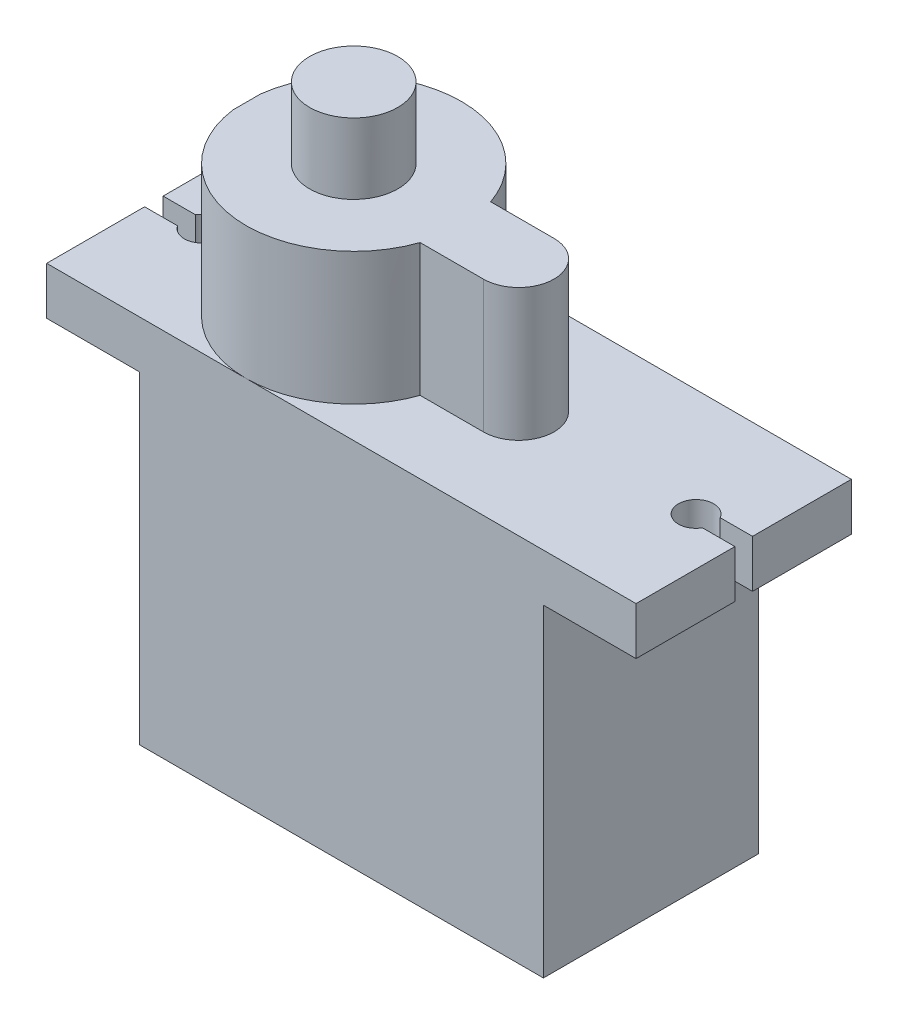
ISO-10303-21;
HEADER;
FILE_DESCRIPTION(('STEP AP214'),'2;1');
FILE_NAME('part.step','',(''),(''),'','','');
FILE_SCHEMA(('AUTOMOTIVE_DESIGN { 1 0 10303 214 1 1 1 1 }'));
ENDSEC;
DATA;
#1=APPLICATION_CONTEXT('core data for automotive mechanical design processes');
#2=APPLICATION_PROTOCOL_DEFINITION('international standard','automotive_design',2000,#1);
#3=PRODUCT_CONTEXT('',#1,'mechanical');
#4=PRODUCT('Part','Part','',(#3));
#5=PRODUCT_RELATED_PRODUCT_CATEGORY('part','',(#4));
#6=PRODUCT_DEFINITION_FORMATION('','',#4);
#7=PRODUCT_DEFINITION_CONTEXT('part definition',#1,'design');
#8=PRODUCT_DEFINITION('design','',#6,#7);
#9=PRODUCT_DEFINITION_SHAPE('','',#8);
#10=(LENGTH_UNIT() NAMED_UNIT(*) SI_UNIT(.MILLI.,.METRE.));
#11=(NAMED_UNIT(*) PLANE_ANGLE_UNIT() SI_UNIT($,.RADIAN.));
#12=(NAMED_UNIT(*) SI_UNIT($,.STERADIAN.) SOLID_ANGLE_UNIT());
#13=UNCERTAINTY_MEASURE_WITH_UNIT(LENGTH_MEASURE(1.E-05),#10,'distance_accuracy_value','');
#14=(GEOMETRIC_REPRESENTATION_CONTEXT(3) GLOBAL_UNCERTAINTY_ASSIGNED_CONTEXT((#13)) GLOBAL_UNIT_ASSIGNED_CONTEXT((#10,
#11,#12)) REPRESENTATION_CONTEXT('',''));
#15=CARTESIAN_POINT('',(0.,0.,0.));
#16=DIRECTION('',(0.,0.,1.));
#17=DIRECTION('',(1.,0.,0.));
#18=AXIS2_PLACEMENT_3D('',#15,#16,#17);
#19=CARTESIAN_POINT('',(28.15,18.3,12.2));
#20=DIRECTION('',(-1.,0.,0.));
#21=DIRECTION('',(0.,0.,1.));
#22=AXIS2_PLACEMENT_3D('',#19,#20,#21);
#23=PLANE('',#22);
#24=DIRECTION('',(0.,0.,-1.));
#25=VECTOR('',#24,1.);
#26=CARTESIAN_POINT('',(28.15,21.,12.2));
#27=LINE('',#26,#25);
#28=CARTESIAN_POINT('',(28.15,21.,5.6));
#29=VERTEX_POINT('',#28);
#30=CARTESIAN_POINT('',(28.15,21.,0.));
#31=VERTEX_POINT('',#30);
#32=EDGE_CURVE('E289',#29,#31,#27,.T.);
#33=ORIENTED_EDGE('',*,*,#32,.F.);
#34=DIRECTION('',(0.,1.,0.));
#35=VECTOR('',#34,1.);
#36=CARTESIAN_POINT('',(28.15,13.5,5.6));
#37=LINE('',#36,#35);
#38=CARTESIAN_POINT('',(28.15,18.3,5.6));
#39=VERTEX_POINT('',#38);
#40=EDGE_CURVE('E273',#39,#29,#37,.T.);
#41=ORIENTED_EDGE('',*,*,#40,.F.);
#42=DIRECTION('',(0.,0.,-1.));
#43=VECTOR('',#42,1.);
#44=CARTESIAN_POINT('',(28.15,18.3,12.2));
#45=LINE('',#44,#43);
#46=CARTESIAN_POINT('',(28.15,18.3,0.));
#47=VERTEX_POINT('',#46);
#48=EDGE_CURVE('E293',#39,#47,#45,.T.);
#49=ORIENTED_EDGE('',*,*,#48,.T.);
#50=DIRECTION('',(0.,1.,0.));
#51=VECTOR('',#50,1.);
#52=CARTESIAN_POINT('',(28.15,18.3,0.));
#53=LINE('',#52,#51);
#54=EDGE_CURVE('E417',#47,#31,#53,.T.);
#55=ORIENTED_EDGE('',*,*,#54,.T.);
#56=EDGE_LOOP('',(#33,#41,#49,#55));
#57=FACE_BOUND('',#56,.T.);
#58=ADVANCED_FACE('F100',(#57),#23,.F.);
#59=CARTESIAN_POINT('',(-5.25,21.,12.2));
#60=DIRECTION('',(1.,0.,0.));
#61=DIRECTION('',(0.,0.,-1.));
#62=AXIS2_PLACEMENT_3D('',#59,#60,#61);
#63=PLANE('',#62);
#64=DIRECTION('',(0.,0.,-1.));
#65=VECTOR('',#64,1.);
#66=CARTESIAN_POINT('',(-5.25,18.3,12.2));
#67=LINE('',#66,#65);
#68=CARTESIAN_POINT('',(-5.25,18.3,5.6));
#69=VERTEX_POINT('',#68);
#70=CARTESIAN_POINT('',(-5.25,18.3,0.));
#71=VERTEX_POINT('',#70);
#72=EDGE_CURVE('E430',#69,#71,#67,.T.);
#73=ORIENTED_EDGE('',*,*,#72,.F.);
#74=DIRECTION('',(0.,1.,0.));
#75=VECTOR('',#74,1.);
#76=CARTESIAN_POINT('',(-5.25,13.5,5.6));
#77=LINE('',#76,#75);
#78=CARTESIAN_POINT('',(-5.25,21.,5.6));
#79=VERTEX_POINT('',#78);
#80=EDGE_CURVE('E260',#69,#79,#77,.T.);
#81=ORIENTED_EDGE('',*,*,#80,.T.);
#82=DIRECTION('',(0.,0.,-1.));
#83=VECTOR('',#82,1.);
#84=CARTESIAN_POINT('',(-5.25,21.,12.2));
#85=LINE('',#84,#83);
#86=CARTESIAN_POINT('',(-5.25,21.,0.));
#87=VERTEX_POINT('',#86);
#88=EDGE_CURVE('E278',#79,#87,#85,.T.);
#89=ORIENTED_EDGE('',*,*,#88,.T.);
#90=DIRECTION('',(0.,-1.,0.));
#91=VECTOR('',#90,1.);
#92=CARTESIAN_POINT('',(-5.25,21.,0.));
#93=LINE('',#92,#91);
#94=EDGE_CURVE('E426',#87,#71,#93,.T.);
#95=ORIENTED_EDGE('',*,*,#94,.T.);
#96=EDGE_LOOP('',(#73,#81,#89,#95));
#97=FACE_BOUND('',#96,.T.);
#98=ADVANCED_FACE('F440',(#97),#63,.F.);
#99=CARTESIAN_POINT('',(0.,28.5,12.2));
#100=DIRECTION('',(0.,-1.,0.));
#101=DIRECTION('',(0.,0.,-1.));
#102=AXIS2_PLACEMENT_3D('',#99,#100,#101);
#103=PLANE('',#102);
#104=CARTESIAN_POINT('',(6.05,28.5,6.1));
#105=DIRECTION('',(0.,-1.,0.));
#106=DIRECTION('',(0.,0.,-1.));
#107=AXIS2_PLACEMENT_3D('',#104,#105,#106);
#108=CIRCLE('',#107,2.5);
#109=CARTESIAN_POINT('',(6.05,28.5,3.6));
#110=VERTEX_POINT('',#109);
#111=EDGE_CURVE('E306',#110,#110,#108,.F.);
#112=ORIENTED_EDGE('',*,*,#111,.F.);
#113=EDGE_LOOP('',(#112));
#114=FACE_BOUND('',#113,.T.);
#115=CARTESIAN_POINT('',(6.05,28.5,6.1));
#116=DIRECTION('',(0.,1.,0.));
#117=DIRECTION('',(0.,0.,1.));
#118=AXIS2_PLACEMENT_3D('',#115,#116,#117);
#119=CIRCLE('',#118,6.1);
#120=CARTESIAN_POINT('',(11.8128118136896,28.5,4.1));
#121=VERTEX_POINT('',#120);
#122=CARTESIAN_POINT('',(0.,28.5,5.32057713659401));
#123=VERTEX_POINT('',#122);
#124=EDGE_CURVE('E339',#121,#123,#119,.T.);
#125=ORIENTED_EDGE('',*,*,#124,.T.);
#126=DIRECTION('',(0.,0.,-1.));
#127=VECTOR('',#126,1.);
#128=CARTESIAN_POINT('',(0.,28.5,12.2));
#129=LINE('',#128,#127);
#130=CARTESIAN_POINT('',(0.,28.5,6.87942286340599));
#131=VERTEX_POINT('',#130);
#132=EDGE_CURVE('E281',#131,#123,#129,.T.);
#133=ORIENTED_EDGE('',*,*,#132,.F.);
#134=CARTESIAN_POINT('',(6.05,28.5,6.1));
#135=DIRECTION('',(0.,1.,0.));
#136=DIRECTION('',(0.,0.,1.));
#137=AXIS2_PLACEMENT_3D('',#134,#135,#136);
#138=CIRCLE('',#137,6.1);
#139=CARTESIAN_POINT('',(11.8128118136896,28.5,8.1));
#140=VERTEX_POINT('',#139);
#141=EDGE_CURVE('E348',#131,#140,#138,.T.);
#142=ORIENTED_EDGE('',*,*,#141,.T.);
#143=DIRECTION('',(-1.,0.,0.));
#144=VECTOR('',#143,1.);
#145=CARTESIAN_POINT('',(0.,28.5,8.09999999999999));
#146=LINE('',#145,#144);
#147=CARTESIAN_POINT('',(15.4,28.5,8.1));
#148=VERTEX_POINT('',#147);
#149=EDGE_CURVE('E365',#148,#140,#146,.T.);
#150=ORIENTED_EDGE('',*,*,#149,.F.);
#151=CARTESIAN_POINT('',(15.4,28.5,6.1));
#152=DIRECTION('',(0.,1.,0.));
#153=DIRECTION('',(0.,0.,1.));
#154=AXIS2_PLACEMENT_3D('',#151,#152,#153);
#155=CIRCLE('',#154,2.);
#156=CARTESIAN_POINT('',(15.4,28.5,4.1));
#157=VERTEX_POINT('',#156);
#158=EDGE_CURVE('E362',#148,#157,#155,.T.);
#159=ORIENTED_EDGE('',*,*,#158,.T.);
#160=DIRECTION('',(-1.,0.,0.));
#161=VECTOR('',#160,1.);
#162=CARTESIAN_POINT('',(0.,28.5,4.1));
#163=LINE('',#162,#161);
#164=EDGE_CURVE('E359',#157,#121,#163,.T.);
#165=ORIENTED_EDGE('',*,*,#164,.T.);
#166=EDGE_LOOP('',(#125,#133,#142,#150,#159,#165));
#167=FACE_BOUND('',#166,.T.);
#168=ADVANCED_FACE('F463',(#114,#167),#103,.F.);
#169=CARTESIAN_POINT('',(0.,21.,12.2));
#170=DIRECTION('',(1.,0.,0.));
#171=DIRECTION('',(0.,1.,0.));
#172=AXIS2_PLACEMENT_3D('',#169,#170,#171);
#173=PLANE('',#172);
#174=DIRECTION('',(0.,1.,0.));
#175=VECTOR('',#174,1.);
#176=CARTESIAN_POINT('',(0.,21.,5.32057713659401));
#177=LINE('',#176,#175);
#178=CARTESIAN_POINT('',(0.,21.,5.32057713659401));
#179=VERTEX_POINT('',#178);
#180=EDGE_CURVE('E335',#179,#123,#177,.T.);
#181=ORIENTED_EDGE('',*,*,#180,.F.);
#182=DIRECTION('',(0.,0.,-1.));
#183=VECTOR('',#182,1.);
#184=CARTESIAN_POINT('',(0.,21.,12.2));
#185=LINE('',#184,#183);
#186=CARTESIAN_POINT('',(0.,21.,6.87942286340599));
#187=VERTEX_POINT('',#186);
#188=EDGE_CURVE('E277',#187,#179,#185,.T.);
#189=ORIENTED_EDGE('',*,*,#188,.F.);
#190=DIRECTION('',(0.,1.,0.));
#191=VECTOR('',#190,1.);
#192=CARTESIAN_POINT('',(0.,21.,6.87942286340599));
#193=LINE('',#192,#191);
#194=EDGE_CURVE('E336',#187,#131,#193,.T.);
#195=ORIENTED_EDGE('',*,*,#194,.T.);
#196=ORIENTED_EDGE('',*,*,#132,.T.);
#197=EDGE_LOOP('',(#181,#189,#195,#196));
#198=FACE_BOUND('',#197,.T.);
#199=ADVANCED_FACE('F461',(#198),#173,.F.);
#200=CARTESIAN_POINT('',(0.,0.,12.2));
#201=DIRECTION('',(0.,0.,-1.));
#202=DIRECTION('',(-1.,0.,0.));
#203=AXIS2_PLACEMENT_3D('',#200,#201,#202);
#204=PLANE('',#203);
#205=DIRECTION('',(-1.,0.,0.));
#206=VECTOR('',#205,1.);
#207=CARTESIAN_POINT('',(22.9,21.,12.2));
#208=LINE('',#207,#206);
#209=CARTESIAN_POINT('',(28.15,21.,12.2));
#210=VERTEX_POINT('',#209);
#211=CARTESIAN_POINT('',(6.05,21.,12.2));
#212=VERTEX_POINT('',#211);
#213=EDGE_CURVE('E399',#210,#212,#208,.T.);
#214=ORIENTED_EDGE('',*,*,#213,.T.);
#215=DIRECTION('',(-1.,0.,0.));
#216=VECTOR('',#215,1.);
#217=CARTESIAN_POINT('',(-5.25,21.,12.2));
#218=LINE('',#217,#216);
#219=CARTESIAN_POINT('',(-5.25,21.,12.2));
#220=VERTEX_POINT('',#219);
#221=EDGE_CURVE('E402',#212,#220,#218,.T.);
#222=ORIENTED_EDGE('',*,*,#221,.T.);
#223=DIRECTION('',(0.,-1.,0.));
#224=VECTOR('',#223,1.);
#225=CARTESIAN_POINT('',(-5.25,21.,12.2));
#226=LINE('',#225,#224);
#227=CARTESIAN_POINT('',(-5.25,18.3,12.2));
#228=VERTEX_POINT('',#227);
#229=EDGE_CURVE('E276',#220,#228,#226,.T.);
#230=ORIENTED_EDGE('',*,*,#229,.T.);
#231=DIRECTION('',(1.,0.,0.));
#232=VECTOR('',#231,1.);
#233=CARTESIAN_POINT('',(-5.25,18.3,12.2));
#234=LINE('',#233,#232);
#235=CARTESIAN_POINT('',(0.,18.3,12.2));
#236=VERTEX_POINT('',#235);
#237=EDGE_CURVE('E405',#228,#236,#234,.T.);
#238=ORIENTED_EDGE('',*,*,#237,.T.);
#239=DIRECTION('',(0.,-1.,0.));
#240=VECTOR('',#239,1.);
#241=CARTESIAN_POINT('',(0.,0.,12.2));
#242=LINE('',#241,#240);
#243=CARTESIAN_POINT('',(0.,0.,12.2));
#244=VERTEX_POINT('',#243);
#245=EDGE_CURVE('E387',#236,#244,#242,.T.);
#246=ORIENTED_EDGE('',*,*,#245,.T.);
#247=DIRECTION('',(1.,0.,0.));
#248=VECTOR('',#247,1.);
#249=CARTESIAN_POINT('',(0.,0.,12.2));
#250=LINE('',#249,#248);
#251=CARTESIAN_POINT('',(22.9,0.,12.2));
#252=VERTEX_POINT('',#251);
#253=EDGE_CURVE('E390',#244,#252,#250,.T.);
#254=ORIENTED_EDGE('',*,*,#253,.T.);
#255=DIRECTION('',(0.,1.,0.));
#256=VECTOR('',#255,1.);
#257=CARTESIAN_POINT('',(22.9,0.,12.2));
#258=LINE('',#257,#256);
#259=CARTESIAN_POINT('',(22.9,18.3,12.2));
#260=VERTEX_POINT('',#259);
#261=EDGE_CURVE('E393',#252,#260,#258,.T.);
#262=ORIENTED_EDGE('',*,*,#261,.T.);
#263=DIRECTION('',(1.,0.,0.));
#264=VECTOR('',#263,1.);
#265=CARTESIAN_POINT('',(22.9,18.3,12.2));
#266=LINE('',#265,#264);
#267=CARTESIAN_POINT('',(28.15,18.3,12.2));
#268=VERTEX_POINT('',#267);
#269=EDGE_CURVE('E395',#260,#268,#266,.T.);
#270=ORIENTED_EDGE('',*,*,#269,.T.);
#271=DIRECTION('',(0.,1.,0.));
#272=VECTOR('',#271,1.);
#273=CARTESIAN_POINT('',(28.15,18.3,12.2));
#274=LINE('',#273,#272);
#275=EDGE_CURVE('E397',#268,#210,#274,.T.);
#276=ORIENTED_EDGE('',*,*,#275,.T.);
#277=EDGE_LOOP('',(#214,#222,#230,#238,#246,#254,#262,#270,#276));
#278=FACE_BOUND('',#277,.T.);
#279=ADVANCED_FACE('F450',(#278),#204,.F.);
#280=CARTESIAN_POINT('',(0.,0.,0.));
#281=DIRECTION('',(0.,0.,-1.));
#282=DIRECTION('',(-1.,0.,0.));
#283=AXIS2_PLACEMENT_3D('',#280,#281,#282);
#284=PLANE('',#283);
#285=DIRECTION('',(-1.,0.,0.));
#286=VECTOR('',#285,1.);
#287=CARTESIAN_POINT('',(-5.25,21.,0.));
#288=LINE('',#287,#286);
#289=CARTESIAN_POINT('',(6.05,21.,0.));
#290=VERTEX_POINT('',#289);
#291=EDGE_CURVE('E423',#290,#87,#288,.T.);
#292=ORIENTED_EDGE('',*,*,#291,.F.);
#293=DIRECTION('',(-1.,0.,0.));
#294=VECTOR('',#293,1.);
#295=CARTESIAN_POINT('',(22.9,21.,0.));
#296=LINE('',#295,#294);
#297=EDGE_CURVE('E420',#31,#290,#296,.T.);
#298=ORIENTED_EDGE('',*,*,#297,.F.);
#299=ORIENTED_EDGE('',*,*,#54,.F.);
#300=DIRECTION('',(1.,0.,0.));
#301=VECTOR('',#300,1.);
#302=CARTESIAN_POINT('',(22.9,18.3,0.));
#303=LINE('',#302,#301);
#304=CARTESIAN_POINT('',(22.9,18.3,0.));
#305=VERTEX_POINT('',#304);
#306=EDGE_CURVE('E414',#305,#47,#303,.T.);
#307=ORIENTED_EDGE('',*,*,#306,.F.);
#308=DIRECTION('',(0.,1.,0.));
#309=VECTOR('',#308,1.);
#310=CARTESIAN_POINT('',(22.9,0.,0.));
#311=LINE('',#310,#309);
#312=CARTESIAN_POINT('',(22.9,0.,0.));
#313=VERTEX_POINT('',#312);
#314=EDGE_CURVE('E412',#313,#305,#311,.T.);
#315=ORIENTED_EDGE('',*,*,#314,.F.);
#316=DIRECTION('',(1.,0.,0.));
#317=VECTOR('',#316,1.);
#318=CARTESIAN_POINT('',(0.,0.,0.));
#319=LINE('',#318,#317);
#320=CARTESIAN_POINT('',(0.,0.,0.));
#321=VERTEX_POINT('',#320);
#322=EDGE_CURVE('E410',#321,#313,#319,.T.);
#323=ORIENTED_EDGE('',*,*,#322,.F.);
#324=DIRECTION('',(0.,-1.,0.));
#325=VECTOR('',#324,1.);
#326=CARTESIAN_POINT('',(0.,0.,0.));
#327=LINE('',#326,#325);
#328=CARTESIAN_POINT('',(0.,18.3,0.));
#329=VERTEX_POINT('',#328);
#330=EDGE_CURVE('E386',#329,#321,#327,.T.);
#331=ORIENTED_EDGE('',*,*,#330,.F.);
#332=DIRECTION('',(1.,0.,0.));
#333=VECTOR('',#332,1.);
#334=CARTESIAN_POINT('',(-5.25,18.3,0.));
#335=LINE('',#334,#333);
#336=EDGE_CURVE('E391',#71,#329,#335,.T.);
#337=ORIENTED_EDGE('',*,*,#336,.F.);
#338=ORIENTED_EDGE('',*,*,#94,.F.);
#339=EDGE_LOOP('',(#292,#298,#299,#307,#315,#323,#331,#337,#338));
#340=FACE_BOUND('',#339,.T.);
#341=ADVANCED_FACE('F442',(#340),#284,.T.);
#342=CARTESIAN_POINT('',(0.,0.,12.2));
#343=DIRECTION('',(1.,0.,0.));
#344=DIRECTION('',(0.,1.,0.));
#345=AXIS2_PLACEMENT_3D('',#342,#343,#344);
#346=PLANE('',#345);
#347=ORIENTED_EDGE('',*,*,#330,.T.);
#348=DIRECTION('',(0.,0.,-1.));
#349=VECTOR('',#348,1.);
#350=CARTESIAN_POINT('',(0.,0.,12.2));
#351=LINE('',#350,#349);
#352=EDGE_CURVE('E303',#244,#321,#351,.T.);
#353=ORIENTED_EDGE('',*,*,#352,.F.);
#354=ORIENTED_EDGE('',*,*,#245,.F.);
#355=DIRECTION('',(0.,0.,-1.));
#356=VECTOR('',#355,1.);
#357=CARTESIAN_POINT('',(0.,18.3,12.2));
#358=LINE('',#357,#356);
#359=EDGE_CURVE('E407',#236,#329,#358,.T.);
#360=ORIENTED_EDGE('',*,*,#359,.T.);
#361=EDGE_LOOP('',(#347,#353,#354,#360));
#362=FACE_BOUND('',#361,.T.);
#363=ADVANCED_FACE('F102',(#362),#346,.F.);
#364=CARTESIAN_POINT('',(0.,0.,12.2));
#365=DIRECTION('',(0.,1.,0.));
#366=DIRECTION('',(0.,0.,1.));
#367=AXIS2_PLACEMENT_3D('',#364,#365,#366);
#368=PLANE('',#367);
#369=ORIENTED_EDGE('',*,*,#322,.T.);
#370=DIRECTION('',(0.,0.,-1.));
#371=VECTOR('',#370,1.);
#372=CARTESIAN_POINT('',(22.9,0.,12.2));
#373=LINE('',#372,#371);
#374=EDGE_CURVE('E300',#252,#313,#373,.T.);
#375=ORIENTED_EDGE('',*,*,#374,.F.);
#376=ORIENTED_EDGE('',*,*,#253,.F.);
#377=ORIENTED_EDGE('',*,*,#352,.T.);
#378=EDGE_LOOP('',(#369,#375,#376,#377));
#379=FACE_BOUND('',#378,.T.);
#380=ADVANCED_FACE('F446',(#379),#368,.F.);
#381=CARTESIAN_POINT('',(22.9,0.,12.2));
#382=DIRECTION('',(-1.,0.,0.));
#383=DIRECTION('',(0.,-1.,0.));
#384=AXIS2_PLACEMENT_3D('',#381,#382,#383);
#385=PLANE('',#384);
#386=ORIENTED_EDGE('',*,*,#314,.T.);
#387=DIRECTION('',(0.,0.,-1.));
#388=VECTOR('',#387,1.);
#389=CARTESIAN_POINT('',(22.9,18.3,12.2));
#390=LINE('',#389,#388);
#391=EDGE_CURVE('E297',#260,#305,#390,.T.);
#392=ORIENTED_EDGE('',*,*,#391,.F.);
#393=ORIENTED_EDGE('',*,*,#261,.F.);
#394=ORIENTED_EDGE('',*,*,#374,.T.);
#395=EDGE_LOOP('',(#386,#392,#393,#394));
#396=FACE_BOUND('',#395,.T.);
#397=ADVANCED_FACE('F515',(#396),#385,.F.);
#398=CARTESIAN_POINT('',(22.9,18.3,12.2));
#399=DIRECTION('',(0.,1.,0.));
#400=DIRECTION('',(-1.,0.,0.));
#401=AXIS2_PLACEMENT_3D('',#398,#399,#400);
#402=PLANE('',#401);
#403=ORIENTED_EDGE('',*,*,#48,.F.);
#404=DIRECTION('',(-1.,0.,0.));
#405=VECTOR('',#404,1.);
#406=CARTESIAN_POINT('',(22.9,18.3,5.6));
#407=LINE('',#406,#405);
#408=CARTESIAN_POINT('',(26.3160254037844,18.3,5.6));
#409=VERTEX_POINT('',#408);
#410=EDGE_CURVE('E324',#39,#409,#407,.T.);
#411=ORIENTED_EDGE('',*,*,#410,.T.);
#412=CARTESIAN_POINT('',(25.45,18.3,6.1));
#413=DIRECTION('',(0.,1.,0.));
#414=DIRECTION('',(-1.,0.,0.));
#415=AXIS2_PLACEMENT_3D('',#412,#413,#414);
#416=CIRCLE('',#415,1.);
#417=CARTESIAN_POINT('',(26.3160254037844,18.3,6.6));
#418=VERTEX_POINT('',#417);
#419=EDGE_CURVE('E310',#409,#418,#416,.T.);
#420=ORIENTED_EDGE('',*,*,#419,.T.);
#421=DIRECTION('',(1.,0.,0.));
#422=VECTOR('',#421,1.);
#423=CARTESIAN_POINT('',(22.9,18.3,6.6));
#424=LINE('',#423,#422);
#425=CARTESIAN_POINT('',(28.15,18.3,6.6));
#426=VERTEX_POINT('',#425);
#427=EDGE_CURVE('E329',#418,#426,#424,.T.);
#428=ORIENTED_EDGE('',*,*,#427,.T.);
#429=EDGE_CURVE('E294',#268,#426,#45,.T.);
#430=ORIENTED_EDGE('',*,*,#429,.F.);
#431=ORIENTED_EDGE('',*,*,#269,.F.);
#432=ORIENTED_EDGE('',*,*,#391,.T.);
#433=ORIENTED_EDGE('',*,*,#306,.T.);
#434=EDGE_LOOP('',(#403,#411,#420,#428,#430,#431,#432,#433));
#435=FACE_BOUND('',#434,.T.);
#436=ADVANCED_FACE('F509',(#435),#402,.F.);
#437=ORIENTED_EDGE('',*,*,#429,.T.);
#438=DIRECTION('',(0.,1.,0.));
#439=VECTOR('',#438,1.);
#440=CARTESIAN_POINT('',(28.15,13.5,6.6));
#441=LINE('',#440,#439);
#442=CARTESIAN_POINT('',(28.15,21.,6.6));
#443=VERTEX_POINT('',#442);
#444=EDGE_CURVE('E521',#426,#443,#441,.T.);
#445=ORIENTED_EDGE('',*,*,#444,.T.);
#446=EDGE_CURVE('E290',#210,#443,#27,.T.);
#447=ORIENTED_EDGE('',*,*,#446,.F.);
#448=ORIENTED_EDGE('',*,*,#275,.F.);
#449=EDGE_LOOP('',(#437,#445,#447,#448));
#450=FACE_BOUND('',#449,.T.);
#451=ADVANCED_FACE('F501',(#450),#23,.F.);
#452=CARTESIAN_POINT('',(22.9,21.,12.2));
#453=DIRECTION('',(0.,-1.,0.));
#454=DIRECTION('',(1.,0.,0.));
#455=AXIS2_PLACEMENT_3D('',#452,#453,#454);
#456=PLANE('',#455);
#457=CARTESIAN_POINT('',(25.45,21.,6.1));
#458=DIRECTION('',(0.,1.,0.));
#459=DIRECTION('',(-1.,0.,0.));
#460=AXIS2_PLACEMENT_3D('',#457,#458,#459);
#461=CIRCLE('',#460,1.);
#462=CARTESIAN_POINT('',(26.3160254037844,21.,5.6));
#463=VERTEX_POINT('',#462);
#464=CARTESIAN_POINT('',(26.3160254037844,21.,6.6));
#465=VERTEX_POINT('',#464);
#466=EDGE_CURVE('E380',#463,#465,#461,.T.);
#467=ORIENTED_EDGE('',*,*,#466,.F.);
#468=DIRECTION('',(-1.,0.,0.));
#469=VECTOR('',#468,1.);
#470=CARTESIAN_POINT('',(25.536434787472,21.,5.6));
#471=LINE('',#470,#469);
#472=EDGE_CURVE('E530',#29,#463,#471,.T.);
#473=ORIENTED_EDGE('',*,*,#472,.F.);
#474=ORIENTED_EDGE('',*,*,#32,.T.);
#475=ORIENTED_EDGE('',*,*,#297,.T.);
#476=CARTESIAN_POINT('',(6.05,21.,6.1));
#477=DIRECTION('',(0.,1.,0.));
#478=DIRECTION('',(0.,0.,1.));
#479=AXIS2_PLACEMENT_3D('',#476,#477,#478);
#480=CIRCLE('',#479,6.1);
#481=CARTESIAN_POINT('',(11.8128118136896,21.,4.1));
#482=VERTEX_POINT('',#481);
#483=EDGE_CURVE('E344',#482,#290,#480,.T.);
#484=ORIENTED_EDGE('',*,*,#483,.F.);
#485=DIRECTION('',(-1.,0.,0.));
#486=VECTOR('',#485,1.);
#487=CARTESIAN_POINT('',(0.,21.,4.1));
#488=LINE('',#487,#486);
#489=CARTESIAN_POINT('',(15.4,21.,4.1));
#490=VERTEX_POINT('',#489);
#491=EDGE_CURVE('E347',#490,#482,#488,.T.);
#492=ORIENTED_EDGE('',*,*,#491,.F.);
#493=CARTESIAN_POINT('',(15.4,21.,6.1));
#494=DIRECTION('',(0.,1.,0.));
#495=DIRECTION('',(0.,0.,1.));
#496=AXIS2_PLACEMENT_3D('',#493,#494,#495);
#497=CIRCLE('',#496,2.);
#498=CARTESIAN_POINT('',(15.4,21.,8.1));
#499=VERTEX_POINT('',#498);
#500=EDGE_CURVE('E350',#499,#490,#497,.T.);
#501=ORIENTED_EDGE('',*,*,#500,.F.);
#502=DIRECTION('',(-1.,0.,0.));
#503=VECTOR('',#502,1.);
#504=CARTESIAN_POINT('',(0.,21.,8.09999999999999));
#505=LINE('',#504,#503);
#506=CARTESIAN_POINT('',(11.8128118136896,21.,8.1));
#507=VERTEX_POINT('',#506);
#508=EDGE_CURVE('E352',#499,#507,#505,.T.);
#509=ORIENTED_EDGE('',*,*,#508,.T.);
#510=CARTESIAN_POINT('',(6.05,21.,6.1));
#511=DIRECTION('',(0.,1.,0.));
#512=DIRECTION('',(0.,0.,1.));
#513=AXIS2_PLACEMENT_3D('',#510,#511,#512);
#514=CIRCLE('',#513,6.1);
#515=EDGE_CURVE('E355',#212,#507,#514,.T.);
#516=ORIENTED_EDGE('',*,*,#515,.F.);
#517=ORIENTED_EDGE('',*,*,#213,.F.);
#518=ORIENTED_EDGE('',*,*,#446,.T.);
#519=DIRECTION('',(1.,0.,0.));
#520=VECTOR('',#519,1.);
#521=CARTESIAN_POINT('',(25.536434787472,21.,6.6));
#522=LINE('',#521,#520);
#523=EDGE_CURVE('E533',#465,#443,#522,.T.);
#524=ORIENTED_EDGE('',*,*,#523,.F.);
#525=EDGE_LOOP('',(#467,#473,#474,#475,#484,#492,#501,#509,#516,#517,#518,#524));
#526=FACE_BOUND('',#525,.T.);
#527=ADVANCED_FACE('F475',(#526),#456,.F.);
#528=CARTESIAN_POINT('',(-5.25,21.,12.2));
#529=DIRECTION('',(0.,-1.,0.));
#530=DIRECTION('',(1.,0.,0.));
#531=AXIS2_PLACEMENT_3D('',#528,#529,#530);
#532=PLANE('',#531);
#533=ORIENTED_EDGE('',*,*,#88,.F.);
#534=DIRECTION('',(-1.,0.,0.));
#535=VECTOR('',#534,1.);
#536=CARTESIAN_POINT('',(-5.25,21.,5.6));
#537=LINE('',#536,#535);
#538=CARTESIAN_POINT('',(-3.41602540378444,21.,5.6));
#539=VERTEX_POINT('',#538);
#540=EDGE_CURVE('E261',#539,#79,#537,.T.);
#541=ORIENTED_EDGE('',*,*,#540,.F.);
#542=CARTESIAN_POINT('',(-2.55,21.,6.1));
#543=DIRECTION('',(0.,1.,0.));
#544=DIRECTION('',(-1.,0.,0.));
#545=AXIS2_PLACEMENT_3D('',#542,#543,#544);
#546=CIRCLE('',#545,1.);
#547=CARTESIAN_POINT('',(-3.3851646544245,21.,6.65));
#548=VERTEX_POINT('',#547);
#549=EDGE_CURVE('E272',#548,#539,#546,.T.);
#550=ORIENTED_EDGE('',*,*,#549,.F.);
#551=DIRECTION('',(1.,0.,0.));
#552=VECTOR('',#551,1.);
#553=CARTESIAN_POINT('',(-5.25,21.,6.65));
#554=LINE('',#553,#552);
#555=CARTESIAN_POINT('',(-5.25,21.,6.65));
#556=VERTEX_POINT('',#555);
#557=EDGE_CURVE('E122',#556,#548,#554,.T.);
#558=ORIENTED_EDGE('',*,*,#557,.F.);
#559=EDGE_CURVE('E268',#220,#556,#85,.T.);
#560=ORIENTED_EDGE('',*,*,#559,.F.);
#561=ORIENTED_EDGE('',*,*,#221,.F.);
#562=CARTESIAN_POINT('',(6.05,21.,6.1));
#563=DIRECTION('',(0.,1.,0.));
#564=DIRECTION('',(0.,0.,1.));
#565=AXIS2_PLACEMENT_3D('',#562,#563,#564);
#566=CIRCLE('',#565,6.1);
#567=EDGE_CURVE('E326',#187,#212,#566,.T.);
#568=ORIENTED_EDGE('',*,*,#567,.F.);
#569=ORIENTED_EDGE('',*,*,#188,.T.);
#570=CARTESIAN_POINT('',(6.05,21.,6.1));
#571=DIRECTION('',(0.,1.,0.));
#572=DIRECTION('',(0.,0.,1.));
#573=AXIS2_PLACEMENT_3D('',#570,#571,#572);
#574=CIRCLE('',#573,6.1);
#575=EDGE_CURVE('E333',#290,#179,#574,.T.);
#576=ORIENTED_EDGE('',*,*,#575,.F.);
#577=ORIENTED_EDGE('',*,*,#291,.T.);
#578=EDGE_LOOP('',(#533,#541,#550,#558,#560,#561,#568,#569,#576,#577));
#579=FACE_BOUND('',#578,.T.);
#580=ADVANCED_FACE('F267',(#579),#532,.F.);
#581=ORIENTED_EDGE('',*,*,#559,.T.);
#582=DIRECTION('',(0.,1.,0.));
#583=VECTOR('',#582,1.);
#584=CARTESIAN_POINT('',(-5.25,13.5,6.65));
#585=LINE('',#584,#583);
#586=CARTESIAN_POINT('',(-5.25,18.3,6.65));
#587=VERTEX_POINT('',#586);
#588=EDGE_CURVE('E252',#587,#556,#585,.T.);
#589=ORIENTED_EDGE('',*,*,#588,.F.);
#590=EDGE_CURVE('E283',#228,#587,#67,.T.);
#591=ORIENTED_EDGE('',*,*,#590,.F.);
#592=ORIENTED_EDGE('',*,*,#229,.F.);
#593=EDGE_LOOP('',(#581,#589,#591,#592));
#594=FACE_BOUND('',#593,.T.);
#595=ADVANCED_FACE('F275',(#594),#63,.F.);
#596=CARTESIAN_POINT('',(-5.25,18.3,12.2));
#597=DIRECTION('',(0.,1.,0.));
#598=DIRECTION('',(-1.,0.,0.));
#599=AXIS2_PLACEMENT_3D('',#596,#597,#598);
#600=PLANE('',#599);
#601=CARTESIAN_POINT('',(-2.55,18.3,6.1));
#602=DIRECTION('',(0.,1.,0.));
#603=DIRECTION('',(-1.,0.,0.));
#604=AXIS2_PLACEMENT_3D('',#601,#602,#603);
#605=CIRCLE('',#604,1.);
#606=CARTESIAN_POINT('',(-3.3851646544245,18.3,6.65));
#607=VERTEX_POINT('',#606);
#608=CARTESIAN_POINT('',(-3.41602540378444,18.3,5.6));
#609=VERTEX_POINT('',#608);
#610=EDGE_CURVE('E307',#607,#609,#605,.T.);
#611=ORIENTED_EDGE('',*,*,#610,.T.);
#612=DIRECTION('',(-1.,0.,0.));
#613=VECTOR('',#612,1.);
#614=CARTESIAN_POINT('',(-5.25,18.3,5.6));
#615=LINE('',#614,#613);
#616=EDGE_CURVE('E115',#609,#69,#615,.T.);
#617=ORIENTED_EDGE('',*,*,#616,.T.);
#618=ORIENTED_EDGE('',*,*,#72,.T.);
#619=ORIENTED_EDGE('',*,*,#336,.T.);
#620=ORIENTED_EDGE('',*,*,#359,.F.);
#621=ORIENTED_EDGE('',*,*,#237,.F.);
#622=ORIENTED_EDGE('',*,*,#590,.T.);
#623=DIRECTION('',(1.,0.,0.));
#624=VECTOR('',#623,1.);
#625=CARTESIAN_POINT('',(-5.25,18.3,6.65));
#626=LINE('',#625,#624);
#627=EDGE_CURVE('E255',#587,#607,#626,.T.);
#628=ORIENTED_EDGE('',*,*,#627,.T.);
#629=EDGE_LOOP('',(#611,#617,#618,#619,#620,#621,#622,#628));
#630=FACE_BOUND('',#629,.T.);
#631=ADVANCED_FACE('F322',(#630),#600,.F.);
#632=CARTESIAN_POINT('',(-2.55000000000001,8.5,6.1));
#633=DIRECTION('',(0.,1.,0.));
#634=DIRECTION('',(-1.,0.,0.));
#635=AXIS2_PLACEMENT_3D('',#632,#633,#634);
#636=CYLINDRICAL_SURFACE('',#635,1.);
#637=ORIENTED_EDGE('',*,*,#549,.T.);
#638=DIRECTION('',(0.,1.,0.));
#639=VECTOR('',#638,1.);
#640=CARTESIAN_POINT('',(-3.41602540378445,8.5,5.6));
#641=LINE('',#640,#639);
#642=EDGE_CURVE('E12',#539,#609,#641,.F.);
#643=ORIENTED_EDGE('',*,*,#642,.T.);
#644=ORIENTED_EDGE('',*,*,#610,.F.);
#645=DIRECTION('',(0.,1.,0.));
#646=VECTOR('',#645,1.);
#647=CARTESIAN_POINT('',(-3.38516465442451,8.5,6.65));
#648=LINE('',#647,#646);
#649=EDGE_CURVE('E108',#607,#548,#648,.T.);
#650=ORIENTED_EDGE('',*,*,#649,.T.);
#651=EDGE_LOOP('',(#637,#643,#644,#650));
#652=FACE_BOUND('',#651,.T.);
#653=ADVANCED_FACE('F320',(#652),#636,.F.);
#654=CARTESIAN_POINT('',(25.45,8.49999999999998,6.1));
#655=DIRECTION('',(0.,1.,0.));
#656=DIRECTION('',(-1.,0.,0.));
#657=AXIS2_PLACEMENT_3D('',#654,#655,#656);
#658=CYLINDRICAL_SURFACE('',#657,1.);
#659=ORIENTED_EDGE('',*,*,#419,.F.);
#660=DIRECTION('',(0.,1.,0.));
#661=VECTOR('',#660,1.);
#662=CARTESIAN_POINT('',(26.3160254037844,8.49999999999998,5.6));
#663=LINE('',#662,#661);
#664=EDGE_CURVE('E316',#409,#463,#663,.T.);
#665=ORIENTED_EDGE('',*,*,#664,.T.);
#666=ORIENTED_EDGE('',*,*,#466,.T.);
#667=DIRECTION('',(0.,1.,0.));
#668=VECTOR('',#667,1.);
#669=CARTESIAN_POINT('',(26.3160254037844,8.49999999999998,6.6));
#670=LINE('',#669,#668);
#671=EDGE_CURVE('E313',#465,#418,#670,.F.);
#672=ORIENTED_EDGE('',*,*,#671,.T.);
#673=EDGE_LOOP('',(#659,#665,#666,#672));
#674=FACE_BOUND('',#673,.T.);
#675=ADVANCED_FACE('F561',(#674),#658,.F.);
#676=CARTESIAN_POINT('',(6.05,32.5,6.1));
#677=DIRECTION('',(0.,-1.,0.));
#678=DIRECTION('',(0.,0.,-1.));
#679=AXIS2_PLACEMENT_3D('',#676,#677,#678);
#680=CYLINDRICAL_SURFACE('',#679,2.5);
#681=CARTESIAN_POINT('',(6.05,32.5,6.1));
#682=DIRECTION('',(0.,1.,0.));
#683=DIRECTION('',(0.,0.,1.));
#684=AXIS2_PLACEMENT_3D('',#681,#682,#683);
#685=CIRCLE('',#684,2.5);
#686=CARTESIAN_POINT('',(6.05,32.5,8.6));
#687=VERTEX_POINT('',#686);
#688=EDGE_CURVE('E372',#687,#687,#685,.T.);
#689=ORIENTED_EDGE('',*,*,#688,.F.);
#690=EDGE_LOOP('',(#689));
#691=FACE_BOUND('',#690,.T.);
#692=ORIENTED_EDGE('',*,*,#111,.T.);
#693=EDGE_LOOP('',(#692));
#694=FACE_BOUND('',#693,.T.);
#695=ADVANCED_FACE('F555',(#691,#694),#680,.T.);
#696=CARTESIAN_POINT('',(6.05,32.5,6.1));
#697=DIRECTION('',(0.,1.,0.));
#698=DIRECTION('',(0.,0.,1.));
#699=AXIS2_PLACEMENT_3D('',#696,#697,#698);
#700=PLANE('',#699);
#701=ORIENTED_EDGE('',*,*,#688,.T.);
#702=EDGE_LOOP('',(#701));
#703=FACE_BOUND('',#702,.T.);
#704=ADVANCED_FACE('F551',(#703),#700,.T.);
#705=CARTESIAN_POINT('',(6.05,21.,6.1));
#706=DIRECTION('',(0.,1.,0.));
#707=DIRECTION('',(0.,0.,1.));
#708=AXIS2_PLACEMENT_3D('',#705,#706,#707);
#709=CYLINDRICAL_SURFACE('',#708,6.1);
#710=ORIENTED_EDGE('',*,*,#141,.F.);
#711=ORIENTED_EDGE('',*,*,#194,.F.);
#712=ORIENTED_EDGE('',*,*,#567,.T.);
#713=ORIENTED_EDGE('',*,*,#515,.T.);
#714=DIRECTION('',(0.,1.,0.));
#715=VECTOR('',#714,1.);
#716=CARTESIAN_POINT('',(11.8128118136896,21.,8.1));
#717=LINE('',#716,#715);
#718=EDGE_CURVE('E370',#507,#140,#717,.T.);
#719=ORIENTED_EDGE('',*,*,#718,.T.);
#720=EDGE_LOOP('',(#710,#711,#712,#713,#719));
#721=FACE_BOUND('',#720,.T.);
#722=ADVANCED_FACE('F456',(#721),#709,.T.);
#723=CARTESIAN_POINT('',(0.,21.,8.09999999999999));
#724=DIRECTION('',(0.,0.,-1.));
#725=DIRECTION('',(-1.,0.,0.));
#726=AXIS2_PLACEMENT_3D('',#723,#724,#725);
#727=PLANE('',#726);
#728=ORIENTED_EDGE('',*,*,#149,.T.);
#729=ORIENTED_EDGE('',*,*,#718,.F.);
#730=ORIENTED_EDGE('',*,*,#508,.F.);
#731=DIRECTION('',(0.,1.,0.));
#732=VECTOR('',#731,1.);
#733=CARTESIAN_POINT('',(15.4,21.,8.1));
#734=LINE('',#733,#732);
#735=EDGE_CURVE('E373',#499,#148,#734,.T.);
#736=ORIENTED_EDGE('',*,*,#735,.T.);
#737=EDGE_LOOP('',(#728,#729,#730,#736));
#738=FACE_BOUND('',#737,.T.);
#739=ADVANCED_FACE('F487',(#738),#727,.F.);
#740=CARTESIAN_POINT('',(15.4,21.,6.1));
#741=DIRECTION('',(0.,1.,0.));
#742=DIRECTION('',(0.,0.,1.));
#743=AXIS2_PLACEMENT_3D('',#740,#741,#742);
#744=CYLINDRICAL_SURFACE('',#743,2.);
#745=ORIENTED_EDGE('',*,*,#158,.F.);
#746=ORIENTED_EDGE('',*,*,#735,.F.);
#747=ORIENTED_EDGE('',*,*,#500,.T.);
#748=DIRECTION('',(0.,1.,0.));
#749=VECTOR('',#748,1.);
#750=CARTESIAN_POINT('',(15.4,21.,4.1));
#751=LINE('',#750,#749);
#752=EDGE_CURVE('E375',#490,#157,#751,.T.);
#753=ORIENTED_EDGE('',*,*,#752,.T.);
#754=EDGE_LOOP('',(#745,#746,#747,#753));
#755=FACE_BOUND('',#754,.T.);
#756=ADVANCED_FACE('F489',(#755),#744,.T.);
#757=CARTESIAN_POINT('',(0.,21.,4.1));
#758=DIRECTION('',(0.,0.,-1.));
#759=DIRECTION('',(-1.,0.,0.));
#760=AXIS2_PLACEMENT_3D('',#757,#758,#759);
#761=PLANE('',#760);
#762=ORIENTED_EDGE('',*,*,#164,.F.);
#763=ORIENTED_EDGE('',*,*,#752,.F.);
#764=ORIENTED_EDGE('',*,*,#491,.T.);
#765=DIRECTION('',(0.,1.,0.));
#766=VECTOR('',#765,1.);
#767=CARTESIAN_POINT('',(11.8128118136896,21.,4.1));
#768=LINE('',#767,#766);
#769=EDGE_CURVE('E357',#482,#121,#768,.T.);
#770=ORIENTED_EDGE('',*,*,#769,.T.);
#771=EDGE_LOOP('',(#762,#763,#764,#770));
#772=FACE_BOUND('',#771,.T.);
#773=ADVANCED_FACE('F481',(#772),#761,.T.);
#774=CARTESIAN_POINT('',(6.05,21.,6.1));
#775=DIRECTION('',(0.,1.,0.));
#776=DIRECTION('',(0.,0.,1.));
#777=AXIS2_PLACEMENT_3D('',#774,#775,#776);
#778=CYLINDRICAL_SURFACE('',#777,6.1);
#779=ORIENTED_EDGE('',*,*,#124,.F.);
#780=ORIENTED_EDGE('',*,*,#769,.F.);
#781=ORIENTED_EDGE('',*,*,#483,.T.);
#782=ORIENTED_EDGE('',*,*,#575,.T.);
#783=ORIENTED_EDGE('',*,*,#180,.T.);
#784=EDGE_LOOP('',(#779,#780,#781,#782,#783));
#785=FACE_BOUND('',#784,.T.);
#786=ADVANCED_FACE('F469',(#785),#778,.T.);
#787=CARTESIAN_POINT('',(25.536434787472,13.5,6.6));
#788=DIRECTION('',(0.,0.,1.));
#789=DIRECTION('',(1.,0.,0.));
#790=AXIS2_PLACEMENT_3D('',#787,#788,#789);
#791=PLANE('',#790);
#792=ORIENTED_EDGE('',*,*,#671,.F.);
#793=ORIENTED_EDGE('',*,*,#523,.T.);
#794=ORIENTED_EDGE('',*,*,#444,.F.);
#795=ORIENTED_EDGE('',*,*,#427,.F.);
#796=EDGE_LOOP('',(#792,#793,#794,#795));
#797=FACE_BOUND('',#796,.T.);
#798=ADVANCED_FACE('F546',(#797),#791,.F.);
#799=CARTESIAN_POINT('',(25.536434787472,13.5,5.6));
#800=DIRECTION('',(0.,0.,-1.));
#801=DIRECTION('',(-1.,0.,0.));
#802=AXIS2_PLACEMENT_3D('',#799,#800,#801);
#803=PLANE('',#802);
#804=ORIENTED_EDGE('',*,*,#40,.T.);
#805=ORIENTED_EDGE('',*,*,#472,.T.);
#806=ORIENTED_EDGE('',*,*,#664,.F.);
#807=ORIENTED_EDGE('',*,*,#410,.F.);
#808=EDGE_LOOP('',(#804,#805,#806,#807));
#809=FACE_BOUND('',#808,.T.);
#810=ADVANCED_FACE('F541',(#809),#803,.F.);
#811=CARTESIAN_POINT('',(-5.25,13.5,6.65));
#812=DIRECTION('',(0.,0.,1.));
#813=DIRECTION('',(1.,0.,0.));
#814=AXIS2_PLACEMENT_3D('',#811,#812,#813);
#815=PLANE('',#814);
#816=ORIENTED_EDGE('',*,*,#588,.T.);
#817=ORIENTED_EDGE('',*,*,#557,.T.);
#818=ORIENTED_EDGE('',*,*,#649,.F.);
#819=ORIENTED_EDGE('',*,*,#627,.F.);
#820=EDGE_LOOP('',(#816,#817,#818,#819));
#821=FACE_BOUND('',#820,.T.);
#822=ADVANCED_FACE('F253',(#821),#815,.F.);
#823=CARTESIAN_POINT('',(-5.25,13.5,5.6));
#824=DIRECTION('',(0.,0.,-1.));
#825=DIRECTION('',(-1.,0.,0.));
#826=AXIS2_PLACEMENT_3D('',#823,#824,#825);
#827=PLANE('',#826);
#828=ORIENTED_EDGE('',*,*,#642,.F.);
#829=ORIENTED_EDGE('',*,*,#540,.T.);
#830=ORIENTED_EDGE('',*,*,#80,.F.);
#831=ORIENTED_EDGE('',*,*,#616,.F.);
#832=EDGE_LOOP('',(#828,#829,#830,#831));
#833=FACE_BOUND('',#832,.T.);
#834=ADVANCED_FACE('F535',(#833),#827,.F.);
#835=CLOSED_SHELL('',(#58,#98,#168,#199,#279,#341,#363,#380,#397,#436,#451,#527,#580,#595,#631,
#653,#675,#695,#704,#722,#739,#756,#773,#786,#798,#810,#822,#834));
#836=MANIFOLD_SOLID_BREP('B2',#835);
#837=ADVANCED_BREP_SHAPE_REPRESENTATION('',(#18,#836),#14);
#838=SHAPE_DEFINITION_REPRESENTATION(#9,#837);
ENDSEC;
END-ISO-10303-21;
